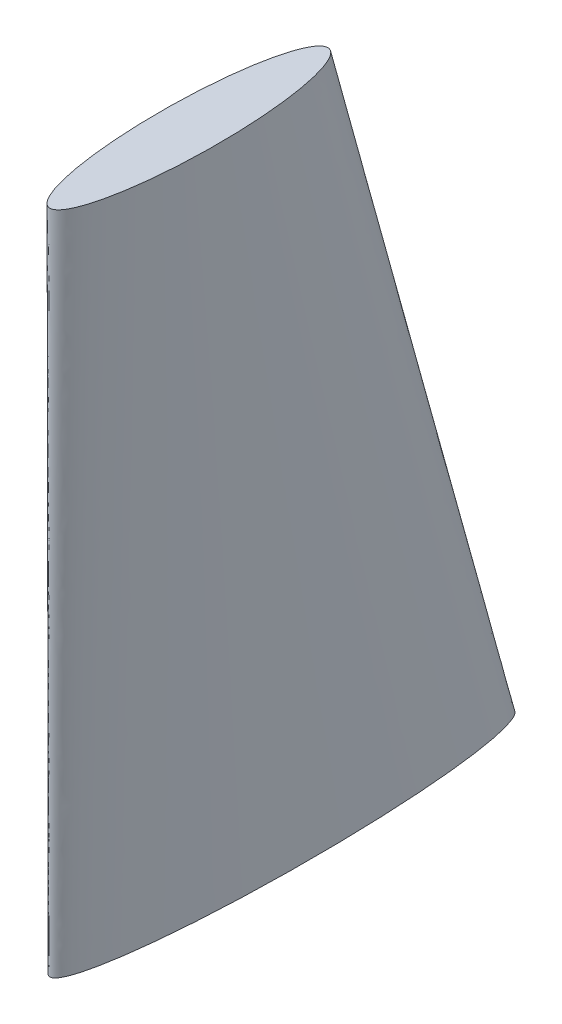
ISO-10303-21;
HEADER;
FILE_DESCRIPTION(('STEP AP214'),'2;1');
FILE_NAME('part.step','',(''),(''),'','','');
FILE_SCHEMA(('AUTOMOTIVE_DESIGN { 1 0 10303 214 1 1 1 1 }'));
ENDSEC;
DATA;
#1=APPLICATION_CONTEXT('core data for automotive mechanical design processes');
#2=APPLICATION_PROTOCOL_DEFINITION('international standard','automotive_design',2000,#1);
#3=PRODUCT_CONTEXT('',#1,'mechanical');
#4=PRODUCT('Part','Part','',(#3));
#5=PRODUCT_RELATED_PRODUCT_CATEGORY('part','',(#4));
#6=PRODUCT_DEFINITION_FORMATION('','',#4);
#7=PRODUCT_DEFINITION_CONTEXT('part definition',#1,'design');
#8=PRODUCT_DEFINITION('design','',#6,#7);
#9=PRODUCT_DEFINITION_SHAPE('','',#8);
#10=(LENGTH_UNIT() NAMED_UNIT(*) SI_UNIT(.MILLI.,.METRE.));
#11=(NAMED_UNIT(*) PLANE_ANGLE_UNIT() SI_UNIT($,.RADIAN.));
#12=(NAMED_UNIT(*) SI_UNIT($,.STERADIAN.) SOLID_ANGLE_UNIT());
#13=UNCERTAINTY_MEASURE_WITH_UNIT(LENGTH_MEASURE(1.E-05),#10,'distance_accuracy_value','');
#14=(GEOMETRIC_REPRESENTATION_CONTEXT(3) GLOBAL_UNCERTAINTY_ASSIGNED_CONTEXT((#13)) GLOBAL_UNIT_ASSIGNED_CONTEXT((#10,
#11,#12)) REPRESENTATION_CONTEXT('',''));
#15=CARTESIAN_POINT('',(0.,0.,0.));
#16=DIRECTION('',(0.,0.,1.));
#17=DIRECTION('',(1.,0.,0.));
#18=AXIS2_PLACEMENT_3D('',#15,#16,#17);
#19=CARTESIAN_POINT('',(0.,352.,49.));
#20=DIRECTION('',(0.,1.,0.));
#21=DIRECTION('',(0.,0.,1.));
#22=AXIS2_PLACEMENT_3D('',#19,#20,#21);
#23=PLANE('',#22);
#24=CARTESIAN_POINT('',(0.,352.,49.));
#25=DIRECTION('',(0.,1.,0.));
#26=DIRECTION('',(0.,0.,1.));
#27=AXIS2_PLACEMENT_3D('',#24,#25,#26);
#28=ELLIPSE('',#27,73.5,15.);
#29=CARTESIAN_POINT('',(0.,352.,122.5));
#30=VERTEX_POINT('',#29);
#31=EDGE_CURVE('E11',#30,#30,#28,.T.);
#32=ORIENTED_EDGE('',*,*,#31,.T.);
#33=EDGE_LOOP('',(#32));
#34=FACE_BOUND('',#33,.T.);
#35=ADVANCED_FACE('F53',(#34),#23,.T.);
#36=CARTESIAN_POINT('',(0.,0.,0.));
#37=DIRECTION('',(0.,1.,0.));
#38=DIRECTION('',(0.,0.,1.));
#39=AXIS2_PLACEMENT_3D('',#36,#37,#38);
#40=PLANE('',#39);
#41=CARTESIAN_POINT('',(0.,0.,0.));
#42=DIRECTION('',(0.,1.,0.));
#43=DIRECTION('',(0.,0.,-1.));
#44=AXIS2_PLACEMENT_3D('',#41,#42,#43);
#45=ELLIPSE('',#44,122.5,15.);
#46=CARTESIAN_POINT('',(0.,0.,-122.5));
#47=VERTEX_POINT('',#46);
#48=EDGE_CURVE('E61',#47,#47,#45,.T.);
#49=ORIENTED_EDGE('',*,*,#48,.F.);
#50=EDGE_LOOP('',(#49));
#51=FACE_BOUND('',#50,.T.);
#52=ADVANCED_FACE('F84',(#51),#40,.F.);
#53=CARTESIAN_POINT('',(0.,0.,-122.5));
#54=CARTESIAN_POINT('',(0.,352.,-24.5));
#55=CARTESIAN_POINT('',(-30.,0.,-122.5));
#56=CARTESIAN_POINT('',(-30.,352.,-24.5));
#57=CARTESIAN_POINT('',(-30.,0.,122.5));
#58=CARTESIAN_POINT('',(-30.,352.,122.5));
#59=CARTESIAN_POINT('',(0.,0.,122.5));
#60=CARTESIAN_POINT('',(0.,352.,122.5));
#61=CARTESIAN_POINT('',(30.,0.,122.5));
#62=CARTESIAN_POINT('',(30.,352.,122.5));
#63=CARTESIAN_POINT('',(30.,0.,-122.5));
#64=CARTESIAN_POINT('',(30.,352.,-24.5));
#65=CARTESIAN_POINT('',(0.,0.,-122.5));
#66=CARTESIAN_POINT('',(0.,352.,-24.5));
#67=(BOUNDED_SURFACE() B_SPLINE_SURFACE(3,1,((#53,#54),(#55,#56),(#57,#58),(#59,#60),(#61,#62),
(#63,#64),(#65,#66)),.UNSPECIFIED.,.T.,.F.,.F.) B_SPLINE_SURFACE_WITH_KNOTS((4,3,4),(2,2),(0.,
0.5,1.),(0.,1.),.UNSPECIFIED.) GEOMETRIC_REPRESENTATION_ITEM() RATIONAL_B_SPLINE_SURFACE(((1.,
1.),(0.333333333333333,0.333333333333333),(0.333333333333333,0.333333333333333),(1.,1.),
(0.333333333333333,0.333333333333333),(0.333333333333333,0.333333333333333),(1.,1.))) REPRESENTATION_ITEM('') SURFACE());
#68=ORIENTED_EDGE('',*,*,#48,.T.);
#69=EDGE_LOOP('',(#68));
#70=FACE_BOUND('',#69,.T.);
#71=ORIENTED_EDGE('',*,*,#31,.F.);
#72=EDGE_LOOP('',(#71));
#73=FACE_BOUND('',#72,.T.);
#74=ADVANCED_FACE('F92',(#70,#73),#67,.T.);
#75=CLOSED_SHELL('',(#35,#52,#74));
#76=MANIFOLD_SOLID_BREP('B2',#75);
#77=ADVANCED_BREP_SHAPE_REPRESENTATION('',(#18,#76),#14);
#78=SHAPE_DEFINITION_REPRESENTATION(#9,#77);
ENDSEC;
END-ISO-10303-21;
